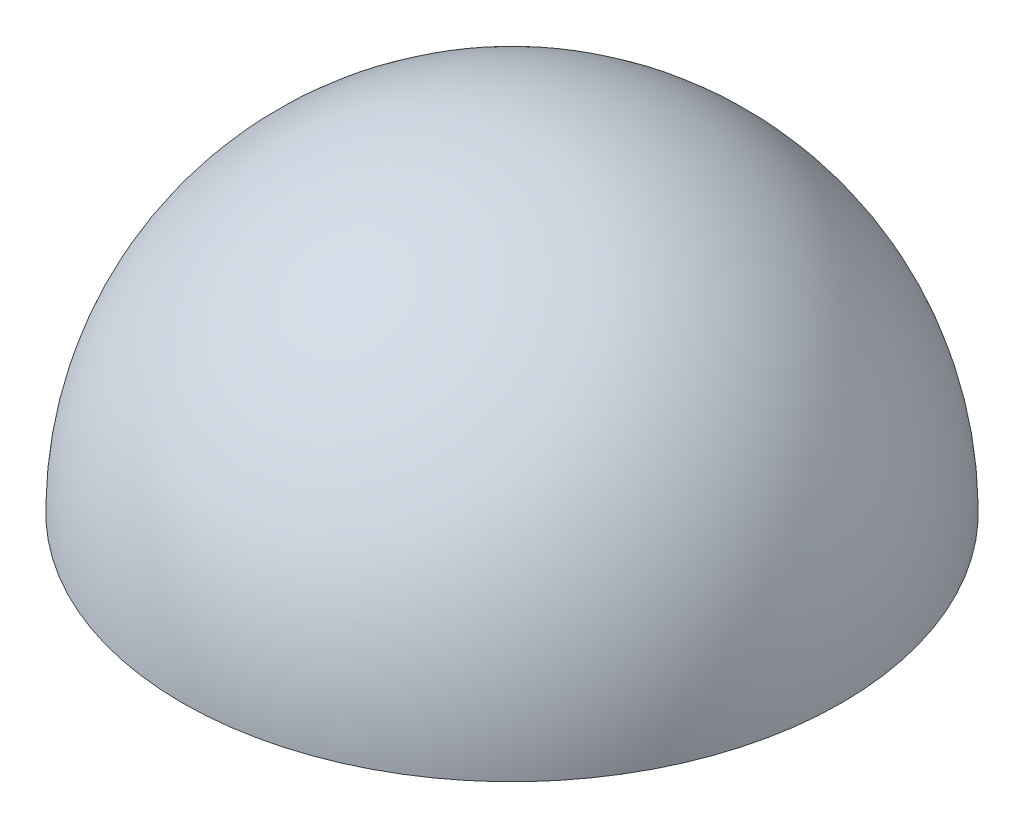
ISO-10303-21;
HEADER;
FILE_DESCRIPTION(('STEP AP214'),'2;1');
FILE_NAME('part.step','',(''),(''),'','','');
FILE_SCHEMA(('AUTOMOTIVE_DESIGN { 1 0 10303 214 1 1 1 1 }'));
ENDSEC;
DATA;
#1=APPLICATION_CONTEXT('core data for automotive mechanical design processes');
#2=APPLICATION_PROTOCOL_DEFINITION('international standard','automotive_design',2000,#1);
#3=PRODUCT_CONTEXT('',#1,'mechanical');
#4=PRODUCT('Part','Part','',(#3));
#5=PRODUCT_RELATED_PRODUCT_CATEGORY('part','',(#4));
#6=PRODUCT_DEFINITION_FORMATION('','',#4);
#7=PRODUCT_DEFINITION_CONTEXT('part definition',#1,'design');
#8=PRODUCT_DEFINITION('design','',#6,#7);
#9=PRODUCT_DEFINITION_SHAPE('','',#8);
#10=(LENGTH_UNIT() NAMED_UNIT(*) SI_UNIT(.MILLI.,.METRE.));
#11=(NAMED_UNIT(*) PLANE_ANGLE_UNIT() SI_UNIT($,.RADIAN.));
#12=(NAMED_UNIT(*) SI_UNIT($,.STERADIAN.) SOLID_ANGLE_UNIT());
#13=UNCERTAINTY_MEASURE_WITH_UNIT(LENGTH_MEASURE(1.E-05),#10,'distance_accuracy_value','');
#14=(GEOMETRIC_REPRESENTATION_CONTEXT(3) GLOBAL_UNCERTAINTY_ASSIGNED_CONTEXT((#13)) GLOBAL_UNIT_ASSIGNED_CONTEXT((#10,
#11,#12)) REPRESENTATION_CONTEXT('',''));
#15=CARTESIAN_POINT('',(0.,0.,0.));
#16=DIRECTION('',(0.,0.,1.));
#17=DIRECTION('',(1.,0.,0.));
#18=AXIS2_PLACEMENT_3D('',#15,#16,#17);
#19=CARTESIAN_POINT('',(0.,0.,0.));
#20=DIRECTION('',(0.,1.,0.));
#21=DIRECTION('',(1.,0.,0.));
#22=AXIS2_PLACEMENT_3D('',#19,#20,#21);
#23=SPHERICAL_SURFACE('',#22,1.5);
#24=CARTESIAN_POINT('',(0.,0.,0.));
#25=DIRECTION('',(0.,1.,0.));
#26=DIRECTION('',(-1.,0.,0.));
#27=AXIS2_PLACEMENT_3D('',#24,#25,#26);
#28=CIRCLE('',#27,1.5);
#29=CARTESIAN_POINT('',(-1.5,0.,0.));
#30=VERTEX_POINT('',#29);
#31=EDGE_CURVE('E10',#30,#30,#28,.T.);
#32=ORIENTED_EDGE('',*,*,#31,.T.);
#33=EDGE_LOOP('',(#32));
#34=FACE_BOUND('',#33,.T.);
#35=ADVANCED_FACE('F31',(#34),#23,.T.);
#36=CARTESIAN_POINT('',(0.,0.,0.));
#37=DIRECTION('',(0.,1.,0.));
#38=DIRECTION('',(-1.,0.,0.));
#39=AXIS2_PLACEMENT_3D('',#36,#37,#38);
#40=PLANE('',#39);
#41=ORIENTED_EDGE('',*,*,#31,.F.);
#42=EDGE_LOOP('',(#41));
#43=FACE_BOUND('',#42,.T.);
#44=ADVANCED_FACE('F39',(#43),#40,.F.);
#45=CLOSED_SHELL('',(#35,#44));
#46=MANIFOLD_SOLID_BREP('B2',#45);
#47=ADVANCED_BREP_SHAPE_REPRESENTATION('',(#18,#46),#14);
#48=SHAPE_DEFINITION_REPRESENTATION(#9,#47);
ENDSEC;
END-ISO-10303-21;
